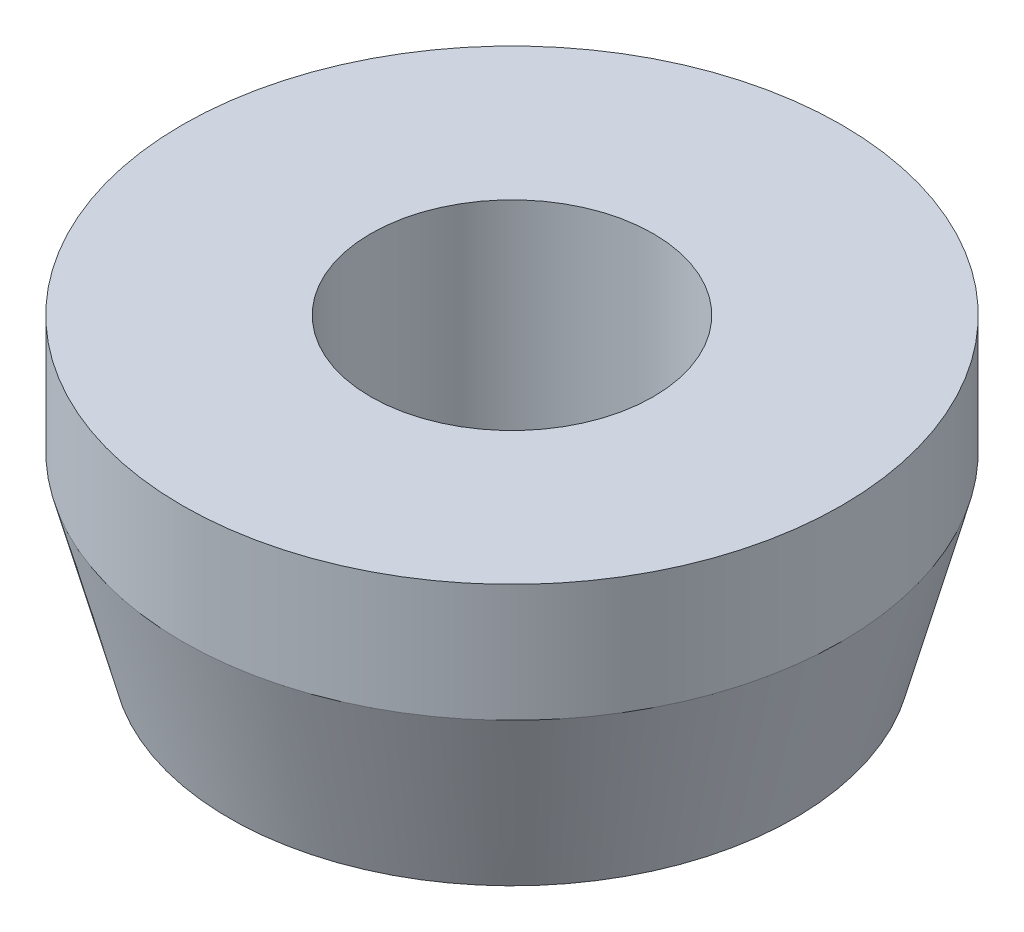
ISO-10303-21;
HEADER;
FILE_DESCRIPTION(('STEP AP214'),'2;1');
FILE_NAME('part.step','',(''),(''),'','','');
FILE_SCHEMA(('AUTOMOTIVE_DESIGN { 1 0 10303 214 1 1 1 1 }'));
ENDSEC;
DATA;
#1=APPLICATION_CONTEXT('core data for automotive mechanical design processes');
#2=APPLICATION_PROTOCOL_DEFINITION('international standard','automotive_design',2000,#1);
#3=PRODUCT_CONTEXT('',#1,'mechanical');
#4=PRODUCT('Part','Part','',(#3));
#5=PRODUCT_RELATED_PRODUCT_CATEGORY('part','',(#4));
#6=PRODUCT_DEFINITION_FORMATION('','',#4);
#7=PRODUCT_DEFINITION_CONTEXT('part definition',#1,'design');
#8=PRODUCT_DEFINITION('design','',#6,#7);
#9=PRODUCT_DEFINITION_SHAPE('','',#8);
#10=(LENGTH_UNIT() NAMED_UNIT(*) SI_UNIT(.MILLI.,.METRE.));
#11=(NAMED_UNIT(*) PLANE_ANGLE_UNIT() SI_UNIT($,.RADIAN.));
#12=(NAMED_UNIT(*) SI_UNIT($,.STERADIAN.) SOLID_ANGLE_UNIT());
#13=UNCERTAINTY_MEASURE_WITH_UNIT(LENGTH_MEASURE(1.E-05),#10,'distance_accuracy_value','');
#14=(GEOMETRIC_REPRESENTATION_CONTEXT(3) GLOBAL_UNCERTAINTY_ASSIGNED_CONTEXT((#13)) GLOBAL_UNIT_ASSIGNED_CONTEXT((#10,
#11,#12)) REPRESENTATION_CONTEXT('',''));
#15=CARTESIAN_POINT('',(0.,0.,0.));
#16=DIRECTION('',(0.,0.,1.));
#17=DIRECTION('',(1.,0.,0.));
#18=AXIS2_PLACEMENT_3D('',#15,#16,#17);
#19=CARTESIAN_POINT('',(0.,0.,0.));
#20=DIRECTION('',(0.,-1.,0.));
#21=DIRECTION('',(0.,0.,-1.));
#22=AXIS2_PLACEMENT_3D('',#19,#20,#21);
#23=CYLINDRICAL_SURFACE('',#22,1.524);
#24=CARTESIAN_POINT('',(0.,0.,0.));
#25=DIRECTION('',(0.,-1.,0.));
#26=DIRECTION('',(0.,0.,-1.));
#27=AXIS2_PLACEMENT_3D('',#24,#25,#26);
#28=CIRCLE('',#27,1.524);
#29=CARTESIAN_POINT('',(0.,0.,-1.524));
#30=VERTEX_POINT('',#29);
#31=EDGE_CURVE('E10',#30,#30,#28,.T.);
#32=ORIENTED_EDGE('',*,*,#31,.T.);
#33=EDGE_LOOP('',(#32));
#34=FACE_BOUND('',#33,.T.);
#35=CARTESIAN_POINT('',(0.,3.175,0.));
#36=DIRECTION('',(0.,-1.,0.));
#37=DIRECTION('',(0.,0.,-1.));
#38=AXIS2_PLACEMENT_3D('',#35,#36,#37);
#39=CIRCLE('',#38,1.524);
#40=CARTESIAN_POINT('',(0.,3.175,-1.524));
#41=VERTEX_POINT('',#40);
#42=EDGE_CURVE('E51',#41,#41,#39,.T.);
#43=ORIENTED_EDGE('',*,*,#42,.F.);
#44=EDGE_LOOP('',(#43));
#45=FACE_BOUND('',#44,.T.);
#46=ADVANCED_FACE('F32',(#34,#45),#23,.F.);
#47=CARTESIAN_POINT('',(1.524,0.,0.));
#48=DIRECTION('',(0.,-1.,0.));
#49=DIRECTION('',(0.,0.,-1.));
#50=AXIS2_PLACEMENT_3D('',#47,#48,#49);
#51=PLANE('',#50);
#52=CARTESIAN_POINT('',(0.,0.,0.));
#53=DIRECTION('',(0.,-1.,0.));
#54=DIRECTION('',(0.,0.,-1.));
#55=AXIS2_PLACEMENT_3D('',#52,#53,#54);
#56=CIRCLE('',#55,3.048);
#57=CARTESIAN_POINT('',(0.,0.,-3.048));
#58=VERTEX_POINT('',#57);
#59=EDGE_CURVE('E38',#58,#58,#56,.T.);
#60=ORIENTED_EDGE('',*,*,#59,.T.);
#61=EDGE_LOOP('',(#60));
#62=FACE_BOUND('',#61,.T.);
#63=ORIENTED_EDGE('',*,*,#31,.F.);
#64=EDGE_LOOP('',(#63));
#65=FACE_BOUND('',#64,.T.);
#66=ADVANCED_FACE('F59',(#62,#65),#51,.T.);
#67=CARTESIAN_POINT('',(0.,0.,0.));
#68=DIRECTION('',(0.,1.,0.));
#69=DIRECTION('',(0.,0.,1.));
#70=AXIS2_PLACEMENT_3D('',#67,#68,#69);
#71=CONICAL_SURFACE('',#70,3.048,0.26060239174734);
#72=CARTESIAN_POINT('',(0.,1.905,0.));
#73=DIRECTION('',(0.,-1.,0.));
#74=DIRECTION('',(0.,0.,-1.));
#75=AXIS2_PLACEMENT_3D('',#72,#73,#74);
#76=CIRCLE('',#75,3.556);
#77=CARTESIAN_POINT('',(0.,1.905,-3.556));
#78=VERTEX_POINT('',#77);
#79=EDGE_CURVE('E42',#78,#78,#76,.T.);
#80=ORIENTED_EDGE('',*,*,#79,.T.);
#81=EDGE_LOOP('',(#80));
#82=FACE_BOUND('',#81,.T.);
#83=ORIENTED_EDGE('',*,*,#59,.F.);
#84=EDGE_LOOP('',(#83));
#85=FACE_BOUND('',#84,.T.);
#86=ADVANCED_FACE('F63',(#82,#85),#71,.T.);
#87=CARTESIAN_POINT('',(0.,0.,0.));
#88=DIRECTION('',(0.,-1.,0.));
#89=DIRECTION('',(0.,0.,-1.));
#90=AXIS2_PLACEMENT_3D('',#87,#88,#89);
#91=CYLINDRICAL_SURFACE('',#90,3.556);
#92=CARTESIAN_POINT('',(0.,3.175,0.));
#93=DIRECTION('',(0.,-1.,0.));
#94=DIRECTION('',(0.,0.,-1.));
#95=AXIS2_PLACEMENT_3D('',#92,#93,#94);
#96=CIRCLE('',#95,3.556);
#97=CARTESIAN_POINT('',(0.,3.175,-3.556));
#98=VERTEX_POINT('',#97);
#99=EDGE_CURVE('E46',#98,#98,#96,.T.);
#100=ORIENTED_EDGE('',*,*,#99,.T.);
#101=EDGE_LOOP('',(#100));
#102=FACE_BOUND('',#101,.T.);
#103=ORIENTED_EDGE('',*,*,#79,.F.);
#104=EDGE_LOOP('',(#103));
#105=FACE_BOUND('',#104,.T.);
#106=ADVANCED_FACE('F67',(#102,#105),#91,.T.);
#107=CARTESIAN_POINT('',(1.524,3.175,0.));
#108=DIRECTION('',(0.,1.,0.));
#109=DIRECTION('',(0.,0.,1.));
#110=AXIS2_PLACEMENT_3D('',#107,#108,#109);
#111=PLANE('',#110);
#112=ORIENTED_EDGE('',*,*,#42,.T.);
#113=EDGE_LOOP('',(#112));
#114=FACE_BOUND('',#113,.T.);
#115=ORIENTED_EDGE('',*,*,#99,.F.);
#116=EDGE_LOOP('',(#115));
#117=FACE_BOUND('',#116,.T.);
#118=ADVANCED_FACE('F55',(#114,#117),#111,.T.);
#119=CLOSED_SHELL('',(#46,#66,#86,#106,#118));
#120=MANIFOLD_SOLID_BREP('B2',#119);
#121=ADVANCED_BREP_SHAPE_REPRESENTATION('',(#18,#120),#14);
#122=SHAPE_DEFINITION_REPRESENTATION(#9,#121);
ENDSEC;
END-ISO-10303-21;
